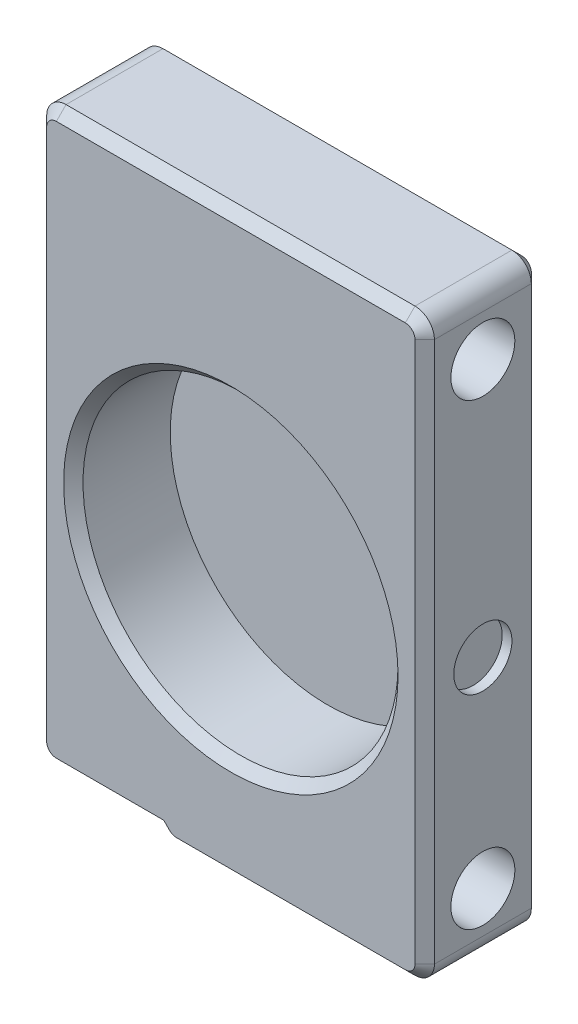
ISO-10303-21;
HEADER;
FILE_DESCRIPTION(('STEP AP214'),'2;1');
FILE_NAME('part.step','',(''),(''),'','','');
FILE_SCHEMA(('AUTOMOTIVE_DESIGN { 1 0 10303 214 1 1 1 1 }'));
ENDSEC;
DATA;
#1=APPLICATION_CONTEXT('core data for automotive mechanical design processes');
#2=APPLICATION_PROTOCOL_DEFINITION('international standard','automotive_design',2000,#1);
#3=PRODUCT_CONTEXT('',#1,'mechanical');
#4=PRODUCT('Part','Part','',(#3));
#5=PRODUCT_RELATED_PRODUCT_CATEGORY('part','',(#4));
#6=PRODUCT_DEFINITION_FORMATION('','',#4);
#7=PRODUCT_DEFINITION_CONTEXT('part definition',#1,'design');
#8=PRODUCT_DEFINITION('design','',#6,#7);
#9=PRODUCT_DEFINITION_SHAPE('','',#8);
#10=(LENGTH_UNIT() NAMED_UNIT(*) SI_UNIT(.MILLI.,.METRE.));
#11=(NAMED_UNIT(*) PLANE_ANGLE_UNIT() SI_UNIT($,.RADIAN.));
#12=(NAMED_UNIT(*) SI_UNIT($,.STERADIAN.) SOLID_ANGLE_UNIT());
#13=UNCERTAINTY_MEASURE_WITH_UNIT(LENGTH_MEASURE(1.E-05),#10,'distance_accuracy_value','');
#14=(GEOMETRIC_REPRESENTATION_CONTEXT(3) GLOBAL_UNCERTAINTY_ASSIGNED_CONTEXT((#13)) GLOBAL_UNIT_ASSIGNED_CONTEXT((#10,
#11,#12)) REPRESENTATION_CONTEXT('',''));
#15=CARTESIAN_POINT('',(0.,0.,0.));
#16=DIRECTION('',(0.,0.,1.));
#17=DIRECTION('',(1.,0.,0.));
#18=AXIS2_PLACEMENT_3D('',#15,#16,#17);
#19=CARTESIAN_POINT('',(-10.,-13.,6.));
#20=DIRECTION('',(1.,0.,0.));
#21=DIRECTION('',(0.,1.,0.));
#22=AXIS2_PLACEMENT_3D('',#19,#20,#21);
#23=PLANE('',#22);
#24=CARTESIAN_POINT('',(-10.,13.32,3.));
#25=DIRECTION('',(1.,0.,0.));
#26=DIRECTION('',(0.,0.,-1.));
#27=AXIS2_PLACEMENT_3D('',#24,#25,#26);
#28=CIRCLE('',#27,1.65);
#29=CARTESIAN_POINT('',(-10.,13.32,1.35));
#30=VERTEX_POINT('',#29);
#31=EDGE_CURVE('E984',#30,#30,#28,.T.);
#32=ORIENTED_EDGE('',*,*,#31,.T.);
#33=EDGE_LOOP('',(#32));
#34=FACE_BOUND('',#33,.T.);
#35=CARTESIAN_POINT('',(-10.,-10.3153910400944,3.));
#36=DIRECTION('',(1.,0.,0.));
#37=DIRECTION('',(0.,0.,1.));
#38=AXIS2_PLACEMENT_3D('',#35,#36,#37);
#39=CIRCLE('',#38,1.65);
#40=CARTESIAN_POINT('',(-10.,-10.3153910400944,4.65));
#41=VERTEX_POINT('',#40);
#42=EDGE_CURVE('E326',#41,#41,#39,.T.);
#43=ORIENTED_EDGE('',*,*,#42,.T.);
#44=EDGE_LOOP('',(#43));
#45=FACE_BOUND('',#44,.T.);
#46=DIRECTION('',(0.,0.,-1.));
#47=VECTOR('',#46,1.);
#48=CARTESIAN_POINT('',(-10.,15.45,6.));
#49=LINE('',#48,#47);
#50=CARTESIAN_POINT('',(-10.,15.45,5.5));
#51=VERTEX_POINT('',#50);
#52=CARTESIAN_POINT('',(-10.,15.45,0.499999999999997));
#53=VERTEX_POINT('',#52);
#54=EDGE_CURVE('E408',#51,#53,#49,.T.);
#55=ORIENTED_EDGE('',*,*,#54,.T.);
#56=DIRECTION('',(0.,-1.,0.));
#57=VECTOR('',#56,1.);
#58=CARTESIAN_POINT('',(-10.,-13.,0.499999999999997));
#59=LINE('',#58,#57);
#60=CARTESIAN_POINT('',(-10.,-12.,0.499999999999997));
#61=VERTEX_POINT('',#60);
#62=EDGE_CURVE('E252',#53,#61,#59,.T.);
#63=ORIENTED_EDGE('',*,*,#62,.T.);
#64=DIRECTION('',(0.,0.,-1.));
#65=VECTOR('',#64,1.);
#66=CARTESIAN_POINT('',(-10.,-12.,6.));
#67=LINE('',#66,#65);
#68=CARTESIAN_POINT('',(-10.,-12.,5.5));
#69=VERTEX_POINT('',#68);
#70=EDGE_CURVE('E404',#61,#69,#67,.F.);
#71=ORIENTED_EDGE('',*,*,#70,.T.);
#72=DIRECTION('',(0.,1.,0.));
#73=VECTOR('',#72,1.);
#74=CARTESIAN_POINT('',(-10.,15.45,5.5));
#75=LINE('',#74,#73);
#76=EDGE_CURVE('E250',#69,#51,#75,.T.);
#77=ORIENTED_EDGE('',*,*,#76,.T.);
#78=EDGE_LOOP('',(#55,#63,#71,#77));
#79=FACE_BOUND('',#78,.T.);
#80=ADVANCED_FACE('F45',(#34,#45,#79),#23,.F.);
#81=CARTESIAN_POINT('',(-10.,-13.,6.));
#82=DIRECTION('',(0.,1.,0.));
#83=DIRECTION('',(0.,0.,1.));
#84=AXIS2_PLACEMENT_3D('',#81,#82,#83);
#85=PLANE('',#84);
#86=DIRECTION('',(0.,0.,-1.));
#87=VECTOR('',#86,1.);
#88=CARTESIAN_POINT('',(-9.,-13.,6.));
#89=LINE('',#88,#87);
#90=CARTESIAN_POINT('',(-9.,-13.,5.5));
#91=VERTEX_POINT('',#90);
#92=CARTESIAN_POINT('',(-9.,-13.,0.499999999999997));
#93=VERTEX_POINT('',#92);
#94=EDGE_CURVE('E217',#91,#93,#89,.T.);
#95=ORIENTED_EDGE('',*,*,#94,.T.);
#96=DIRECTION('',(1.,0.,0.));
#97=VECTOR('',#96,1.);
#98=CARTESIAN_POINT('',(-10.,-13.,0.499999999999997));
#99=LINE('',#98,#97);
#100=CARTESIAN_POINT('',(-3.67004229435026,-13.,0.499999999999997));
#101=VERTEX_POINT('',#100);
#102=EDGE_CURVE('E262',#93,#101,#99,.T.);
#103=ORIENTED_EDGE('',*,*,#102,.T.);
#104=DIRECTION('',(0.,0.,-1.));
#105=VECTOR('',#104,1.);
#106=CARTESIAN_POINT('',(-3.67004229435026,-13.,6.));
#107=LINE('',#106,#105);
#108=CARTESIAN_POINT('',(-3.67004229435026,-13.,5.5));
#109=VERTEX_POINT('',#108);
#110=EDGE_CURVE('E488',#109,#101,#107,.T.);
#111=ORIENTED_EDGE('',*,*,#110,.F.);
#112=DIRECTION('',(-1.,0.,0.));
#113=VECTOR('',#112,1.);
#114=CARTESIAN_POINT('',(-9.,-13.,5.5));
#115=LINE('',#114,#113);
#116=EDGE_CURVE('E259',#109,#91,#115,.T.);
#117=ORIENTED_EDGE('',*,*,#116,.T.);
#118=EDGE_LOOP('',(#95,#103,#111,#117));
#119=FACE_BOUND('',#118,.T.);
#120=ADVANCED_FACE('F484',(#119),#85,.F.);
#121=CARTESIAN_POINT('',(-3.67004229435026,-13.,6.));
#122=DIRECTION('',(0.707106781186549,0.707106781186546,0.));
#123=DIRECTION('',(-0.707106781186546,0.707106781186549,0.));
#124=AXIS2_PLACEMENT_3D('',#121,#122,#123);
#125=PLANE('',#124);
#126=ORIENTED_EDGE('',*,*,#110,.T.);
#127=DIRECTION('',(0.707106781186546,-0.707106781186549,0.));
#128=VECTOR('',#127,1.);
#129=CARTESIAN_POINT('',(-3.67004229435026,-13.,0.499999999999997));
#130=LINE('',#129,#128);
#131=CARTESIAN_POINT('',(-3.51293551316371,-13.1571067811865,0.499999999999997));
#132=VERTEX_POINT('',#131);
#133=EDGE_CURVE('E266',#101,#132,#130,.T.);
#134=ORIENTED_EDGE('',*,*,#133,.T.);
#135=DIRECTION('',(0.,0.,1.));
#136=VECTOR('',#135,1.);
#137=CARTESIAN_POINT('',(-3.51293551316371,-13.1571067811865,6.));
#138=LINE('',#137,#136);
#139=CARTESIAN_POINT('',(-3.51293551316371,-13.1571067811865,5.5));
#140=VERTEX_POINT('',#139);
#141=EDGE_CURVE('E398',#132,#140,#138,.T.);
#142=ORIENTED_EDGE('',*,*,#141,.T.);
#143=DIRECTION('',(-0.707106781186546,0.707106781186549,0.));
#144=VECTOR('',#143,1.);
#145=CARTESIAN_POINT('',(-3.67004229435026,-13.,5.5));
#146=LINE('',#145,#144);
#147=EDGE_CURVE('E264',#140,#109,#146,.T.);
#148=ORIENTED_EDGE('',*,*,#147,.T.);
#149=EDGE_LOOP('',(#126,#134,#142,#148));
#150=FACE_BOUND('',#149,.T.);
#151=ADVANCED_FACE('F522',(#150),#125,.F.);
#152=CARTESIAN_POINT('',(10.,-13.5,6.));
#153=DIRECTION('',(-1.,0.,0.));
#154=DIRECTION('',(0.,0.,1.));
#155=AXIS2_PLACEMENT_3D('',#152,#153,#154);
#156=PLANE('',#155);
#157=CARTESIAN_POINT('',(10.,13.32,3.));
#158=DIRECTION('',(1.,0.,0.));
#159=DIRECTION('',(0.,0.,-1.));
#160=AXIS2_PLACEMENT_3D('',#157,#158,#159);
#161=CIRCLE('',#160,1.65);
#162=CARTESIAN_POINT('',(10.,13.32,1.35));
#163=VERTEX_POINT('',#162);
#164=EDGE_CURVE('E993',#163,#163,#161,.T.);
#165=ORIENTED_EDGE('',*,*,#164,.F.);
#166=EDGE_LOOP('',(#165));
#167=FACE_BOUND('',#166,.T.);
#168=CARTESIAN_POINT('',(10.,-10.3153910400944,3.));
#169=DIRECTION('',(1.,0.,0.));
#170=DIRECTION('',(0.,0.,1.));
#171=AXIS2_PLACEMENT_3D('',#168,#169,#170);
#172=CIRCLE('',#171,1.65);
#173=CARTESIAN_POINT('',(10.,-10.3153910400944,4.65));
#174=VERTEX_POINT('',#173);
#175=EDGE_CURVE('E989',#174,#174,#172,.T.);
#176=ORIENTED_EDGE('',*,*,#175,.F.);
#177=EDGE_LOOP('',(#176));
#178=FACE_BOUND('',#177,.T.);
#179=CARTESIAN_POINT('',(10.,0.,3.));
#180=DIRECTION('',(1.,0.,0.));
#181=DIRECTION('',(0.,0.,-1.));
#182=AXIS2_PLACEMENT_3D('',#179,#180,#181);
#183=CIRCLE('',#182,1.5);
#184=CARTESIAN_POINT('',(10.,0.,1.5));
#185=VERTEX_POINT('',#184);
#186=EDGE_CURVE('E975',#185,#185,#183,.T.);
#187=ORIENTED_EDGE('',*,*,#186,.F.);
#188=EDGE_LOOP('',(#187));
#189=FACE_BOUND('',#188,.T.);
#190=DIRECTION('',(0.,0.,-1.));
#191=VECTOR('',#190,1.);
#192=CARTESIAN_POINT('',(10.,-12.45,6.));
#193=LINE('',#192,#191);
#194=CARTESIAN_POINT('',(10.,-12.45,5.5));
#195=VERTEX_POINT('',#194);
#196=CARTESIAN_POINT('',(10.,-12.45,0.499999999999997));
#197=VERTEX_POINT('',#196);
#198=EDGE_CURVE('E396',#195,#197,#193,.T.);
#199=ORIENTED_EDGE('',*,*,#198,.T.);
#200=DIRECTION('',(0.,1.,0.));
#201=VECTOR('',#200,1.);
#202=CARTESIAN_POINT('',(10.,-13.5,0.499999999999997));
#203=LINE('',#202,#201);
#204=CARTESIAN_POINT('',(10.,15.45,0.499999999999997));
#205=VERTEX_POINT('',#204);
#206=EDGE_CURVE('E235',#197,#205,#203,.T.);
#207=ORIENTED_EDGE('',*,*,#206,.T.);
#208=DIRECTION('',(0.,0.,-1.));
#209=VECTOR('',#208,1.);
#210=CARTESIAN_POINT('',(10.,15.45,6.));
#211=LINE('',#210,#209);
#212=CARTESIAN_POINT('',(10.,15.45,5.5));
#213=VERTEX_POINT('',#212);
#214=EDGE_CURVE('E393',#205,#213,#211,.F.);
#215=ORIENTED_EDGE('',*,*,#214,.T.);
#216=DIRECTION('',(0.,-1.,0.));
#217=VECTOR('',#216,1.);
#218=CARTESIAN_POINT('',(10.,-12.45,5.5));
#219=LINE('',#218,#217);
#220=EDGE_CURVE('E232',#213,#195,#219,.T.);
#221=ORIENTED_EDGE('',*,*,#220,.T.);
#222=EDGE_LOOP('',(#199,#207,#215,#221));
#223=FACE_BOUND('',#222,.T.);
#224=ADVANCED_FACE('F446',(#167,#178,#189,#223),#156,.F.);
#225=CARTESIAN_POINT('',(0.,0.,6.));
#226=DIRECTION('',(0.,0.,1.));
#227=DIRECTION('',(1.,0.,0.));
#228=AXIS2_PLACEMENT_3D('',#225,#226,#227);
#229=PLANE('',#228);
#230=CARTESIAN_POINT('',(0.,0.,6.));
#231=DIRECTION('',(0.,0.,1.));
#232=DIRECTION('',(1.,0.,0.));
#233=AXIS2_PLACEMENT_3D('',#230,#231,#232);
#234=CIRCLE('',#233,8.62500000000002);
#235=CARTESIAN_POINT('',(8.62500000000002,0.,6.));
#236=VERTEX_POINT('',#235);
#237=EDGE_CURVE('E11',#236,#236,#234,.F.);
#238=ORIENTED_EDGE('',*,*,#237,.T.);
#239=EDGE_LOOP('',(#238));
#240=FACE_BOUND('',#239,.T.);
#241=CARTESIAN_POINT('',(-9.,-12.,6.));
#242=DIRECTION('',(0.,0.,1.));
#243=DIRECTION('',(1.,0.,0.));
#244=AXIS2_PLACEMENT_3D('',#241,#242,#243);
#245=CIRCLE('',#244,0.500000000000002);
#246=CARTESIAN_POINT('',(-9.5,-12.,6.));
#247=VERTEX_POINT('',#246);
#248=CARTESIAN_POINT('',(-9.,-12.5,6.));
#249=VERTEX_POINT('',#248);
#250=EDGE_CURVE('E63',#247,#249,#245,.T.);
#251=ORIENTED_EDGE('',*,*,#250,.T.);
#252=DIRECTION('',(1.,0.,0.));
#253=VECTOR('',#252,1.);
#254=CARTESIAN_POINT('',(-3.67004229435026,-12.5,6.));
#255=LINE('',#254,#253);
#256=CARTESIAN_POINT('',(-3.46293551316371,-12.5,6.));
#257=VERTEX_POINT('',#256);
#258=EDGE_CURVE('E55',#249,#257,#255,.T.);
#259=ORIENTED_EDGE('',*,*,#258,.T.);
#260=DIRECTION('',(0.707106781186546,-0.707106781186549,0.));
#261=VECTOR('',#260,1.);
#262=CARTESIAN_POINT('',(-3.15938212257044,-12.8035533905933,6.));
#263=LINE('',#262,#261);
#264=CARTESIAN_POINT('',(-3.15938212257044,-12.8035533905933,6.));
#265=VERTEX_POINT('',#264);
#266=EDGE_CURVE('E280',#257,#265,#263,.T.);
#267=ORIENTED_EDGE('',*,*,#266,.T.);
#268=CARTESIAN_POINT('',(-2.80582873197717,-12.45,6.));
#269=DIRECTION('',(0.,0.,1.));
#270=DIRECTION('',(1.,0.,0.));
#271=AXIS2_PLACEMENT_3D('',#268,#269,#270);
#272=CIRCLE('',#271,0.5);
#273=CARTESIAN_POINT('',(-2.80582873197716,-12.95,6.));
#274=VERTEX_POINT('',#273);
#275=EDGE_CURVE('E282',#265,#274,#272,.T.);
#276=ORIENTED_EDGE('',*,*,#275,.T.);
#277=DIRECTION('',(1.,0.,0.));
#278=VECTOR('',#277,1.);
#279=CARTESIAN_POINT('',(9.,-12.95,6.));
#280=LINE('',#279,#278);
#281=CARTESIAN_POINT('',(9.,-12.95,6.));
#282=VERTEX_POINT('',#281);
#283=EDGE_CURVE('E284',#274,#282,#280,.T.);
#284=ORIENTED_EDGE('',*,*,#283,.T.);
#285=CARTESIAN_POINT('',(9.,-12.45,6.));
#286=DIRECTION('',(0.,0.,1.));
#287=DIRECTION('',(1.,0.,0.));
#288=AXIS2_PLACEMENT_3D('',#285,#286,#287);
#289=CIRCLE('',#288,0.500000000000002);
#290=CARTESIAN_POINT('',(9.5,-12.45,6.));
#291=VERTEX_POINT('',#290);
#292=EDGE_CURVE('E286',#282,#291,#289,.T.);
#293=ORIENTED_EDGE('',*,*,#292,.T.);
#294=DIRECTION('',(0.,1.,0.));
#295=VECTOR('',#294,1.);
#296=CARTESIAN_POINT('',(9.5,15.45,6.));
#297=LINE('',#296,#295);
#298=CARTESIAN_POINT('',(9.5,15.45,6.));
#299=VERTEX_POINT('',#298);
#300=EDGE_CURVE('E288',#291,#299,#297,.T.);
#301=ORIENTED_EDGE('',*,*,#300,.T.);
#302=CARTESIAN_POINT('',(9.,15.45,6.));
#303=DIRECTION('',(0.,0.,1.));
#304=DIRECTION('',(1.,0.,0.));
#305=AXIS2_PLACEMENT_3D('',#302,#303,#304);
#306=CIRCLE('',#305,0.500000000000004);
#307=CARTESIAN_POINT('',(9.,15.95,6.));
#308=VERTEX_POINT('',#307);
#309=EDGE_CURVE('E290',#299,#308,#306,.T.);
#310=ORIENTED_EDGE('',*,*,#309,.T.);
#311=DIRECTION('',(-1.,0.,0.));
#312=VECTOR('',#311,1.);
#313=CARTESIAN_POINT('',(-9.00000000000001,15.95,6.));
#314=LINE('',#313,#312);
#315=CARTESIAN_POINT('',(-9.00000000000001,15.95,6.));
#316=VERTEX_POINT('',#315);
#317=EDGE_CURVE('E292',#308,#316,#314,.T.);
#318=ORIENTED_EDGE('',*,*,#317,.T.);
#319=CARTESIAN_POINT('',(-9.,15.45,6.));
#320=DIRECTION('',(0.,0.,1.));
#321=DIRECTION('',(1.,0.,0.));
#322=AXIS2_PLACEMENT_3D('',#319,#320,#321);
#323=CIRCLE('',#322,0.500000000000002);
#324=CARTESIAN_POINT('',(-9.50000000000001,15.45,6.));
#325=VERTEX_POINT('',#324);
#326=EDGE_CURVE('E294',#316,#325,#323,.T.);
#327=ORIENTED_EDGE('',*,*,#326,.T.);
#328=DIRECTION('',(0.,-1.,0.));
#329=VECTOR('',#328,1.);
#330=CARTESIAN_POINT('',(-9.5,-12.,6.));
#331=LINE('',#330,#329);
#332=EDGE_CURVE('E68',#325,#247,#331,.T.);
#333=ORIENTED_EDGE('',*,*,#332,.T.);
#334=EDGE_LOOP('',(#251,#259,#267,#276,#284,#293,#301,#310,#318,#327,#333));
#335=FACE_BOUND('',#334,.T.);
#336=ADVANCED_FACE('F367',(#240,#335),#229,.T.);
#337=CARTESIAN_POINT('',(0.,0.,0.));
#338=DIRECTION('',(0.,0.,1.));
#339=DIRECTION('',(1.,0.,0.));
#340=AXIS2_PLACEMENT_3D('',#337,#338,#339);
#341=PLANE('',#340);
#342=DIRECTION('',(0.,-1.,0.));
#343=VECTOR('',#342,1.);
#344=CARTESIAN_POINT('',(9.5,0.,0.));
#345=LINE('',#344,#343);
#346=CARTESIAN_POINT('',(9.5,15.45,0.));
#347=VERTEX_POINT('',#346);
#348=CARTESIAN_POINT('',(9.5,-12.45,0.));
#349=VERTEX_POINT('',#348);
#350=EDGE_CURVE('E221',#347,#349,#345,.T.);
#351=ORIENTED_EDGE('',*,*,#350,.T.);
#352=CARTESIAN_POINT('',(9.,-12.45,0.));
#353=DIRECTION('',(0.,0.,1.));
#354=DIRECTION('',(1.,0.,0.));
#355=AXIS2_PLACEMENT_3D('',#352,#353,#354);
#356=CIRCLE('',#355,0.500000000000004);
#357=CARTESIAN_POINT('',(9.,-12.95,0.));
#358=VERTEX_POINT('',#357);
#359=EDGE_CURVE('E202',#349,#358,#356,.F.);
#360=ORIENTED_EDGE('',*,*,#359,.T.);
#361=DIRECTION('',(-1.,0.,0.));
#362=VECTOR('',#361,1.);
#363=CARTESIAN_POINT('',(0.,-12.95,0.));
#364=LINE('',#363,#362);
#365=CARTESIAN_POINT('',(-2.80582873197716,-12.95,0.));
#366=VERTEX_POINT('',#365);
#367=EDGE_CURVE('E210',#358,#366,#364,.T.);
#368=ORIENTED_EDGE('',*,*,#367,.T.);
#369=CARTESIAN_POINT('',(-2.80582873197717,-12.45,0.));
#370=DIRECTION('',(0.,0.,1.));
#371=DIRECTION('',(1.,0.,0.));
#372=AXIS2_PLACEMENT_3D('',#369,#370,#371);
#373=CIRCLE('',#372,0.500000000000003);
#374=CARTESIAN_POINT('',(-3.15938212257044,-12.8035533905933,0.));
#375=VERTEX_POINT('',#374);
#376=EDGE_CURVE('E216',#366,#375,#373,.F.);
#377=ORIENTED_EDGE('',*,*,#376,.T.);
#378=DIRECTION('',(-0.707106781186546,0.707106781186549,0.));
#379=VECTOR('',#378,1.);
#380=CARTESIAN_POINT('',(-7.98146775658186,-7.98146775658184,0.));
#381=LINE('',#380,#379);
#382=CARTESIAN_POINT('',(-3.46293551316371,-12.5,0.));
#383=VERTEX_POINT('',#382);
#384=EDGE_CURVE('E420',#375,#383,#381,.T.);
#385=ORIENTED_EDGE('',*,*,#384,.T.);
#386=DIRECTION('',(-1.,0.,0.));
#387=VECTOR('',#386,1.);
#388=CARTESIAN_POINT('',(0.,-12.5,0.));
#389=LINE('',#388,#387);
#390=CARTESIAN_POINT('',(-9.,-12.5,0.));
#391=VERTEX_POINT('',#390);
#392=EDGE_CURVE('E422',#383,#391,#389,.T.);
#393=ORIENTED_EDGE('',*,*,#392,.T.);
#394=CARTESIAN_POINT('',(-9.,-12.,0.));
#395=DIRECTION('',(0.,0.,1.));
#396=DIRECTION('',(1.,0.,0.));
#397=AXIS2_PLACEMENT_3D('',#394,#395,#396);
#398=CIRCLE('',#397,0.500000000000002);
#399=CARTESIAN_POINT('',(-9.5,-12.,0.));
#400=VERTEX_POINT('',#399);
#401=EDGE_CURVE('E424',#391,#400,#398,.F.);
#402=ORIENTED_EDGE('',*,*,#401,.T.);
#403=DIRECTION('',(0.,1.,0.));
#404=VECTOR('',#403,1.);
#405=CARTESIAN_POINT('',(-9.5,0.,0.));
#406=LINE('',#405,#404);
#407=CARTESIAN_POINT('',(-9.50000000000001,15.45,0.));
#408=VERTEX_POINT('',#407);
#409=EDGE_CURVE('E426',#400,#408,#406,.T.);
#410=ORIENTED_EDGE('',*,*,#409,.T.);
#411=CARTESIAN_POINT('',(-9.,15.45,0.));
#412=DIRECTION('',(0.,0.,1.));
#413=DIRECTION('',(1.,0.,0.));
#414=AXIS2_PLACEMENT_3D('',#411,#412,#413);
#415=CIRCLE('',#414,0.500000000000002);
#416=CARTESIAN_POINT('',(-9.00000000000001,15.95,0.));
#417=VERTEX_POINT('',#416);
#418=EDGE_CURVE('E428',#408,#417,#415,.F.);
#419=ORIENTED_EDGE('',*,*,#418,.T.);
#420=DIRECTION('',(1.,0.,0.));
#421=VECTOR('',#420,1.);
#422=CARTESIAN_POINT('',(0.,15.95,0.));
#423=LINE('',#422,#421);
#424=CARTESIAN_POINT('',(9.,15.95,0.));
#425=VERTEX_POINT('',#424);
#426=EDGE_CURVE('E430',#417,#425,#423,.T.);
#427=ORIENTED_EDGE('',*,*,#426,.T.);
#428=CARTESIAN_POINT('',(9.,15.45,0.));
#429=DIRECTION('',(0.,0.,1.));
#430=DIRECTION('',(1.,0.,0.));
#431=AXIS2_PLACEMENT_3D('',#428,#429,#430);
#432=CIRCLE('',#431,0.500000000000004);
#433=EDGE_CURVE('E227',#425,#347,#432,.F.);
#434=ORIENTED_EDGE('',*,*,#433,.T.);
#435=EDGE_LOOP('',(#351,#360,#368,#377,#385,#393,#402,#410,#419,#427,#434));
#436=FACE_BOUND('',#435,.T.);
#437=ADVANCED_FACE('F219',(#436),#341,.F.);
#438=CARTESIAN_POINT('',(0.,0.,1.));
#439=DIRECTION('',(0.,0.,1.));
#440=DIRECTION('',(1.,0.,0.));
#441=AXIS2_PLACEMENT_3D('',#438,#439,#440);
#442=CYLINDRICAL_SURFACE('',#441,8.125);
#443=CARTESIAN_POINT('',(0.,0.,5.49999999999999));
#444=DIRECTION('',(0.,0.,1.));
#445=DIRECTION('',(1.,0.,0.));
#446=AXIS2_PLACEMENT_3D('',#443,#444,#445);
#447=CIRCLE('',#446,8.125);
#448=CARTESIAN_POINT('',(8.125,0.,5.49999999999999));
#449=VERTEX_POINT('',#448);
#450=EDGE_CURVE('E276',#449,#449,#447,.T.);
#451=ORIENTED_EDGE('',*,*,#450,.T.);
#452=EDGE_LOOP('',(#451));
#453=FACE_BOUND('',#452,.T.);
#454=CARTESIAN_POINT('',(0.,0.,1.));
#455=DIRECTION('',(0.,0.,1.));
#456=DIRECTION('',(1.,0.,0.));
#457=AXIS2_PLACEMENT_3D('',#454,#455,#456);
#458=CIRCLE('',#457,8.125);
#459=CARTESIAN_POINT('',(8.125,0.,1.));
#460=VERTEX_POINT('',#459);
#461=EDGE_CURVE('E967',#460,#460,#458,.T.);
#462=ORIENTED_EDGE('',*,*,#461,.F.);
#463=EDGE_LOOP('',(#462));
#464=FACE_BOUND('',#463,.T.);
#465=ADVANCED_FACE('F758',(#453,#464),#442,.F.);
#466=CARTESIAN_POINT('',(0.,0.,1.));
#467=DIRECTION('',(0.,0.,1.));
#468=DIRECTION('',(1.,0.,0.));
#469=AXIS2_PLACEMENT_3D('',#466,#467,#468);
#470=PLANE('',#469);
#471=ORIENTED_EDGE('',*,*,#461,.T.);
#472=EDGE_LOOP('',(#471));
#473=FACE_BOUND('',#472,.T.);
#474=ADVANCED_FACE('F763',(#473),#470,.T.);
#475=CARTESIAN_POINT('',(9.5,0.,3.));
#476=DIRECTION('',(1.,0.,0.));
#477=DIRECTION('',(0.,0.,-1.));
#478=AXIS2_PLACEMENT_3D('',#475,#476,#477);
#479=CYLINDRICAL_SURFACE('',#478,1.5);
#480=CARTESIAN_POINT('',(9.5,0.,3.));
#481=DIRECTION('',(1.,0.,0.));
#482=DIRECTION('',(0.,0.,-1.));
#483=AXIS2_PLACEMENT_3D('',#480,#481,#482);
#484=CIRCLE('',#483,1.5);
#485=CARTESIAN_POINT('',(9.5,0.,1.5));
#486=VERTEX_POINT('',#485);
#487=EDGE_CURVE('E970',#486,#486,#484,.T.);
#488=ORIENTED_EDGE('',*,*,#487,.F.);
#489=EDGE_LOOP('',(#488));
#490=FACE_BOUND('',#489,.T.);
#491=ORIENTED_EDGE('',*,*,#186,.T.);
#492=EDGE_LOOP('',(#491));
#493=FACE_BOUND('',#492,.T.);
#494=ADVANCED_FACE('F843',(#490,#493),#479,.F.);
#495=CARTESIAN_POINT('',(9.5,0.,3.));
#496=DIRECTION('',(1.,0.,0.));
#497=DIRECTION('',(0.,0.,-1.));
#498=AXIS2_PLACEMENT_3D('',#495,#496,#497);
#499=PLANE('',#498);
#500=ORIENTED_EDGE('',*,*,#487,.T.);
#501=EDGE_LOOP('',(#500));
#502=FACE_BOUND('',#501,.T.);
#503=ADVANCED_FACE('F833',(#502),#499,.T.);
#504=CARTESIAN_POINT('',(-10.,-10.3153910400944,3.));
#505=DIRECTION('',(1.,0.,0.));
#506=DIRECTION('',(0.,0.,-1.));
#507=AXIS2_PLACEMENT_3D('',#504,#505,#506);
#508=CYLINDRICAL_SURFACE('',#507,1.65);
#509=ORIENTED_EDGE('',*,*,#42,.F.);
#510=EDGE_LOOP('',(#509));
#511=FACE_BOUND('',#510,.T.);
#512=ORIENTED_EDGE('',*,*,#175,.T.);
#513=EDGE_LOOP('',(#512));
#514=FACE_BOUND('',#513,.T.);
#515=ADVANCED_FACE('F822',(#511,#514),#508,.F.);
#516=CARTESIAN_POINT('',(-10.,13.32,3.));
#517=DIRECTION('',(1.,0.,0.));
#518=DIRECTION('',(0.,0.,-1.));
#519=AXIS2_PLACEMENT_3D('',#516,#517,#518);
#520=CYLINDRICAL_SURFACE('',#519,1.65);
#521=ORIENTED_EDGE('',*,*,#31,.F.);
#522=EDGE_LOOP('',(#521));
#523=FACE_BOUND('',#522,.T.);
#524=ORIENTED_EDGE('',*,*,#164,.T.);
#525=EDGE_LOOP('',(#524));
#526=FACE_BOUND('',#525,.T.);
#527=ADVANCED_FACE('F752',(#523,#526),#520,.F.);
#528=CARTESIAN_POINT('',(10.,-13.45,6.));
#529=DIRECTION('',(0.,1.,0.));
#530=DIRECTION('',(0.,0.,1.));
#531=AXIS2_PLACEMENT_3D('',#528,#529,#530);
#532=PLANE('',#531);
#533=DIRECTION('',(0.,0.,1.));
#534=VECTOR('',#533,1.);
#535=CARTESIAN_POINT('',(-2.80582873197716,-13.45,6.));
#536=LINE('',#535,#534);
#537=CARTESIAN_POINT('',(-2.80582873197716,-13.45,5.5));
#538=VERTEX_POINT('',#537);
#539=CARTESIAN_POINT('',(-2.80582873197716,-13.45,0.499999999999997));
#540=VERTEX_POINT('',#539);
#541=EDGE_CURVE('E385',#538,#540,#536,.F.);
#542=ORIENTED_EDGE('',*,*,#541,.T.);
#543=DIRECTION('',(1.,0.,0.));
#544=VECTOR('',#543,1.);
#545=CARTESIAN_POINT('',(10.,-13.45,0.499999999999997));
#546=LINE('',#545,#544);
#547=CARTESIAN_POINT('',(9.,-13.45,0.499999999999997));
#548=VERTEX_POINT('',#547);
#549=EDGE_CURVE('E274',#540,#548,#546,.T.);
#550=ORIENTED_EDGE('',*,*,#549,.T.);
#551=DIRECTION('',(0.,0.,-1.));
#552=VECTOR('',#551,1.);
#553=CARTESIAN_POINT('',(9.,-13.45,6.));
#554=LINE('',#553,#552);
#555=CARTESIAN_POINT('',(9.,-13.45,5.5));
#556=VERTEX_POINT('',#555);
#557=EDGE_CURVE('E387',#548,#556,#554,.F.);
#558=ORIENTED_EDGE('',*,*,#557,.T.);
#559=DIRECTION('',(-1.,0.,0.));
#560=VECTOR('',#559,1.);
#561=CARTESIAN_POINT('',(-2.80582873197716,-13.45,5.5));
#562=LINE('',#561,#560);
#563=EDGE_CURVE('E272',#556,#538,#562,.T.);
#564=ORIENTED_EDGE('',*,*,#563,.T.);
#565=EDGE_LOOP('',(#542,#550,#558,#564));
#566=FACE_BOUND('',#565,.T.);
#567=ADVANCED_FACE('F384',(#566),#532,.F.);
#568=CARTESIAN_POINT('',(10.,16.45,6.));
#569=DIRECTION('',(0.,-1.,0.));
#570=DIRECTION('',(0.,0.,-1.));
#571=AXIS2_PLACEMENT_3D('',#568,#569,#570);
#572=PLANE('',#571);
#573=DIRECTION('',(0.,0.,-1.));
#574=VECTOR('',#573,1.);
#575=CARTESIAN_POINT('',(9.,16.45,6.));
#576=LINE('',#575,#574);
#577=CARTESIAN_POINT('',(9.,16.45,5.5));
#578=VERTEX_POINT('',#577);
#579=CARTESIAN_POINT('',(9.,16.45,0.499999999999997));
#580=VERTEX_POINT('',#579);
#581=EDGE_CURVE('E411',#578,#580,#576,.T.);
#582=ORIENTED_EDGE('',*,*,#581,.T.);
#583=DIRECTION('',(-1.,0.,0.));
#584=VECTOR('',#583,1.);
#585=CARTESIAN_POINT('',(10.,16.45,0.499999999999997));
#586=LINE('',#585,#584);
#587=CARTESIAN_POINT('',(-9.00000000000001,16.45,0.499999999999997));
#588=VERTEX_POINT('',#587);
#589=EDGE_CURVE('E244',#580,#588,#586,.T.);
#590=ORIENTED_EDGE('',*,*,#589,.T.);
#591=DIRECTION('',(0.,0.,-1.));
#592=VECTOR('',#591,1.);
#593=CARTESIAN_POINT('',(-9.00000000000001,16.45,6.));
#594=LINE('',#593,#592);
#595=CARTESIAN_POINT('',(-9.00000000000001,16.45,5.5));
#596=VERTEX_POINT('',#595);
#597=EDGE_CURVE('E414',#588,#596,#594,.F.);
#598=ORIENTED_EDGE('',*,*,#597,.T.);
#599=DIRECTION('',(1.,0.,0.));
#600=VECTOR('',#599,1.);
#601=CARTESIAN_POINT('',(9.,16.45,5.5));
#602=LINE('',#601,#600);
#603=EDGE_CURVE('E242',#596,#578,#602,.T.);
#604=ORIENTED_EDGE('',*,*,#603,.T.);
#605=EDGE_LOOP('',(#582,#590,#598,#604));
#606=FACE_BOUND('',#605,.T.);
#607=ADVANCED_FACE('F452',(#606),#572,.F.);
#608=CARTESIAN_POINT('',(-2.80582873197717,-12.45,6.));
#609=DIRECTION('',(0.,0.,1.));
#610=DIRECTION('',(1.,0.,0.));
#611=AXIS2_PLACEMENT_3D('',#608,#609,#610);
#612=CYLINDRICAL_SURFACE('',#611,1.);
#613=ORIENTED_EDGE('',*,*,#141,.F.);
#614=CARTESIAN_POINT('',(-2.80582873197717,-12.45,0.499999999999997));
#615=DIRECTION('',(0.,0.,1.));
#616=DIRECTION('',(1.,0.,0.));
#617=AXIS2_PLACEMENT_3D('',#614,#615,#616);
#618=CIRCLE('',#617,1.);
#619=EDGE_CURVE('E270',#132,#540,#618,.T.);
#620=ORIENTED_EDGE('',*,*,#619,.T.);
#621=ORIENTED_EDGE('',*,*,#541,.F.);
#622=CARTESIAN_POINT('',(-2.80582873197717,-12.45,5.5));
#623=DIRECTION('',(0.,0.,1.));
#624=DIRECTION('',(1.,0.,0.));
#625=AXIS2_PLACEMENT_3D('',#622,#623,#624);
#626=CIRCLE('',#625,1.);
#627=EDGE_CURVE('E268',#538,#140,#626,.F.);
#628=ORIENTED_EDGE('',*,*,#627,.T.);
#629=EDGE_LOOP('',(#613,#620,#621,#628));
#630=FACE_BOUND('',#629,.T.);
#631=ADVANCED_FACE('F390',(#630),#612,.T.);
#632=CARTESIAN_POINT('',(9.,-12.45,6.));
#633=DIRECTION('',(0.,0.,-1.));
#634=DIRECTION('',(-1.,0.,0.));
#635=AXIS2_PLACEMENT_3D('',#632,#633,#634);
#636=CYLINDRICAL_SURFACE('',#635,1.);
#637=ORIENTED_EDGE('',*,*,#557,.F.);
#638=CARTESIAN_POINT('',(9.,-12.45,0.499999999999997));
#639=DIRECTION('',(0.,0.,1.));
#640=DIRECTION('',(1.,0.,0.));
#641=AXIS2_PLACEMENT_3D('',#638,#639,#640);
#642=CIRCLE('',#641,1.);
#643=EDGE_CURVE('E204',#548,#197,#642,.T.);
#644=ORIENTED_EDGE('',*,*,#643,.T.);
#645=ORIENTED_EDGE('',*,*,#198,.F.);
#646=CARTESIAN_POINT('',(9.,-12.45,5.5));
#647=DIRECTION('',(0.,0.,1.));
#648=DIRECTION('',(1.,0.,0.));
#649=AXIS2_PLACEMENT_3D('',#646,#647,#648);
#650=CIRCLE('',#649,1.);
#651=EDGE_CURVE('E223',#195,#556,#650,.F.);
#652=ORIENTED_EDGE('',*,*,#651,.T.);
#653=EDGE_LOOP('',(#637,#644,#645,#652));
#654=FACE_BOUND('',#653,.T.);
#655=ADVANCED_FACE('F445',(#654),#636,.T.);
#656=CARTESIAN_POINT('',(-9.,15.45,6.));
#657=DIRECTION('',(0.,0.,-1.));
#658=DIRECTION('',(-1.,0.,0.));
#659=AXIS2_PLACEMENT_3D('',#656,#657,#658);
#660=CYLINDRICAL_SURFACE('',#659,1.);
#661=ORIENTED_EDGE('',*,*,#597,.F.);
#662=CARTESIAN_POINT('',(-9.,15.45,0.499999999999997));
#663=DIRECTION('',(0.,0.,1.));
#664=DIRECTION('',(1.,0.,0.));
#665=AXIS2_PLACEMENT_3D('',#662,#663,#664);
#666=CIRCLE('',#665,1.);
#667=EDGE_CURVE('E248',#588,#53,#666,.T.);
#668=ORIENTED_EDGE('',*,*,#667,.T.);
#669=ORIENTED_EDGE('',*,*,#54,.F.);
#670=CARTESIAN_POINT('',(-9.,15.45,5.5));
#671=DIRECTION('',(0.,0.,1.));
#672=DIRECTION('',(1.,0.,0.));
#673=AXIS2_PLACEMENT_3D('',#670,#671,#672);
#674=CIRCLE('',#673,1.);
#675=EDGE_CURVE('E246',#51,#596,#674,.F.);
#676=ORIENTED_EDGE('',*,*,#675,.T.);
#677=EDGE_LOOP('',(#661,#668,#669,#676));
#678=FACE_BOUND('',#677,.T.);
#679=ADVANCED_FACE('F464',(#678),#660,.T.);
#680=CARTESIAN_POINT('',(9.,15.45,6.));
#681=DIRECTION('',(0.,0.,-1.));
#682=DIRECTION('',(-1.,0.,0.));
#683=AXIS2_PLACEMENT_3D('',#680,#681,#682);
#684=CYLINDRICAL_SURFACE('',#683,1.);
#685=ORIENTED_EDGE('',*,*,#214,.F.);
#686=CARTESIAN_POINT('',(9.,15.45,0.499999999999997));
#687=DIRECTION('',(0.,0.,1.));
#688=DIRECTION('',(1.,0.,0.));
#689=AXIS2_PLACEMENT_3D('',#686,#687,#688);
#690=CIRCLE('',#689,1.);
#691=EDGE_CURVE('E240',#205,#580,#690,.T.);
#692=ORIENTED_EDGE('',*,*,#691,.T.);
#693=ORIENTED_EDGE('',*,*,#581,.F.);
#694=CARTESIAN_POINT('',(9.,15.45,5.5));
#695=DIRECTION('',(0.,0.,1.));
#696=DIRECTION('',(1.,0.,0.));
#697=AXIS2_PLACEMENT_3D('',#694,#695,#696);
#698=CIRCLE('',#697,1.);
#699=EDGE_CURVE('E238',#578,#213,#698,.F.);
#700=ORIENTED_EDGE('',*,*,#699,.T.);
#701=EDGE_LOOP('',(#685,#692,#693,#700));
#702=FACE_BOUND('',#701,.T.);
#703=ADVANCED_FACE('F448',(#702),#684,.T.);
#704=CARTESIAN_POINT('',(-9.,-12.,6.));
#705=DIRECTION('',(0.,0.,-1.));
#706=DIRECTION('',(-1.,0.,0.));
#707=AXIS2_PLACEMENT_3D('',#704,#705,#706);
#708=CYLINDRICAL_SURFACE('',#707,1.);
#709=ORIENTED_EDGE('',*,*,#70,.F.);
#710=CARTESIAN_POINT('',(-9.,-12.,0.499999999999997));
#711=DIRECTION('',(0.,0.,1.));
#712=DIRECTION('',(1.,0.,0.));
#713=AXIS2_PLACEMENT_3D('',#710,#711,#712);
#714=CIRCLE('',#713,1.);
#715=EDGE_CURVE('E257',#61,#93,#714,.T.);
#716=ORIENTED_EDGE('',*,*,#715,.T.);
#717=ORIENTED_EDGE('',*,*,#94,.F.);
#718=CARTESIAN_POINT('',(-9.,-12.,5.5));
#719=DIRECTION('',(0.,0.,1.));
#720=DIRECTION('',(1.,0.,0.));
#721=AXIS2_PLACEMENT_3D('',#718,#719,#720);
#722=CIRCLE('',#721,1.);
#723=EDGE_CURVE('E255',#91,#69,#722,.F.);
#724=ORIENTED_EDGE('',*,*,#723,.T.);
#725=EDGE_LOOP('',(#709,#716,#717,#724));
#726=FACE_BOUND('',#725,.T.);
#727=ADVANCED_FACE('F482',(#726),#708,.T.);
#728=CARTESIAN_POINT('',(-10.,-13.,0.499999999999997));
#729=DIRECTION('',(0.707106781186547,0.,0.707106781186548));
#730=DIRECTION('',(0.,-1.,0.));
#731=AXIS2_PLACEMENT_3D('',#728,#729,#730);
#732=PLANE('',#731);
#733=DIRECTION('',(-0.707106781186547,0.,0.707106781186547));
#734=VECTOR('',#733,1.);
#735=CARTESIAN_POINT('',(-9.50000000000001,15.45,0.));
#736=LINE('',#735,#734);
#737=EDGE_CURVE('E320',#408,#53,#736,.T.);
#738=ORIENTED_EDGE('',*,*,#737,.F.);
#739=ORIENTED_EDGE('',*,*,#409,.F.);
#740=DIRECTION('',(0.707106781186547,0.,-0.707106781186547));
#741=VECTOR('',#740,1.);
#742=CARTESIAN_POINT('',(-10.,-12.,0.499999999999997));
#743=LINE('',#742,#741);
#744=EDGE_CURVE('E323',#61,#400,#743,.T.);
#745=ORIENTED_EDGE('',*,*,#744,.F.);
#746=ORIENTED_EDGE('',*,*,#62,.F.);
#747=EDGE_LOOP('',(#738,#739,#745,#746));
#748=FACE_BOUND('',#747,.T.);
#749=ADVANCED_FACE('F472',(#748),#732,.F.);
#750=CARTESIAN_POINT('',(-9.,-12.,0.));
#751=DIRECTION('',(0.,0.,1.));
#752=DIRECTION('',(1.,0.,0.));
#753=AXIS2_PLACEMENT_3D('',#750,#751,#752);
#754=CONICAL_SURFACE('',#753,0.500000000000002,0.785398163397449);
#755=ORIENTED_EDGE('',*,*,#744,.T.);
#756=ORIENTED_EDGE('',*,*,#401,.F.);
#757=DIRECTION('',(0.,0.707106781186549,-0.707106781186546));
#758=VECTOR('',#757,1.);
#759=CARTESIAN_POINT('',(-9.,-13.,0.499999999999997));
#760=LINE('',#759,#758);
#761=EDGE_CURVE('E317',#93,#391,#760,.T.);
#762=ORIENTED_EDGE('',*,*,#761,.F.);
#763=ORIENTED_EDGE('',*,*,#715,.F.);
#764=EDGE_LOOP('',(#755,#756,#762,#763));
#765=FACE_BOUND('',#764,.T.);
#766=ADVANCED_FACE('F478',(#765),#754,.T.);
#767=CARTESIAN_POINT('',(-9.,15.45,0.));
#768=DIRECTION('',(0.,0.,1.));
#769=DIRECTION('',(1.,0.,0.));
#770=AXIS2_PLACEMENT_3D('',#767,#768,#769);
#771=CONICAL_SURFACE('',#770,0.500000000000002,0.785398163397449);
#772=ORIENTED_EDGE('',*,*,#737,.T.);
#773=ORIENTED_EDGE('',*,*,#667,.F.);
#774=DIRECTION('',(0.,0.707106781186547,0.707106781186547));
#775=VECTOR('',#774,1.);
#776=CARTESIAN_POINT('',(-9.00000000000001,15.95,0.));
#777=LINE('',#776,#775);
#778=EDGE_CURVE('E314',#417,#588,#777,.T.);
#779=ORIENTED_EDGE('',*,*,#778,.F.);
#780=ORIENTED_EDGE('',*,*,#418,.F.);
#781=EDGE_LOOP('',(#772,#773,#779,#780));
#782=FACE_BOUND('',#781,.T.);
#783=ADVANCED_FACE('F460',(#782),#771,.T.);
#784=CARTESIAN_POINT('',(-10.,-13.,0.499999999999997));
#785=DIRECTION('',(0.,0.707106781186547,0.707106781186547));
#786=DIRECTION('',(1.,0.,0.));
#787=AXIS2_PLACEMENT_3D('',#784,#785,#786);
#788=PLANE('',#787);
#789=ORIENTED_EDGE('',*,*,#761,.T.);
#790=ORIENTED_EDGE('',*,*,#392,.F.);
#791=DIRECTION('',(0.28108463771482,0.678598344545847,-0.678598344545847));
#792=VECTOR('',#791,1.);
#793=CARTESIAN_POINT('',(-4.17016322336417,-14.207398729652,1.707398729652));
#794=LINE('',#793,#792);
#795=EDGE_CURVE('E311',#101,#383,#794,.T.);
#796=ORIENTED_EDGE('',*,*,#795,.F.);
#797=ORIENTED_EDGE('',*,*,#102,.F.);
#798=EDGE_LOOP('',(#789,#790,#796,#797));
#799=FACE_BOUND('',#798,.T.);
#800=ADVANCED_FACE('F580',(#799),#788,.F.);
#801=CARTESIAN_POINT('',(10.,16.45,0.499999999999997));
#802=DIRECTION('',(0.,-0.707106781186547,0.707106781186547));
#803=DIRECTION('',(-1.,0.,0.));
#804=AXIS2_PLACEMENT_3D('',#801,#802,#803);
#805=PLANE('',#804);
#806=ORIENTED_EDGE('',*,*,#778,.T.);
#807=ORIENTED_EDGE('',*,*,#589,.F.);
#808=DIRECTION('',(0.,0.707106781186547,0.707106781186547));
#809=VECTOR('',#808,1.);
#810=CARTESIAN_POINT('',(9.,15.95,0.));
#811=LINE('',#810,#809);
#812=EDGE_CURVE('E308',#425,#580,#811,.T.);
#813=ORIENTED_EDGE('',*,*,#812,.F.);
#814=ORIENTED_EDGE('',*,*,#426,.F.);
#815=EDGE_LOOP('',(#806,#807,#813,#814));
#816=FACE_BOUND('',#815,.T.);
#817=ADVANCED_FACE('F455',(#816),#805,.F.);
#818=CARTESIAN_POINT('',(-3.67004229435026,-13.,0.499999999999997));
#819=DIRECTION('',(0.500000000000001,0.499999999999999,0.707106781186547));
#820=DIRECTION('',(0.707106781186546,-0.707106781186549,0.));
#821=AXIS2_PLACEMENT_3D('',#818,#819,#820);
#822=PLANE('',#821);
#823=ORIENTED_EDGE('',*,*,#795,.T.);
#824=ORIENTED_EDGE('',*,*,#384,.F.);
#825=DIRECTION('',(0.5,0.499999999999999,-0.707106781186548));
#826=VECTOR('',#825,1.);
#827=CARTESIAN_POINT('',(-3.51293551316371,-13.1571067811865,0.499999999999997));
#828=LINE('',#827,#826);
#829=EDGE_CURVE('E305',#132,#375,#828,.T.);
#830=ORIENTED_EDGE('',*,*,#829,.F.);
#831=ORIENTED_EDGE('',*,*,#133,.F.);
#832=EDGE_LOOP('',(#823,#824,#830,#831));
#833=FACE_BOUND('',#832,.T.);
#834=ADVANCED_FACE('F568',(#833),#822,.F.);
#835=CARTESIAN_POINT('',(9.,15.45,0.));
#836=DIRECTION('',(0.,0.,1.));
#837=DIRECTION('',(1.,0.,0.));
#838=AXIS2_PLACEMENT_3D('',#835,#836,#837);
#839=CONICAL_SURFACE('',#838,0.500000000000004,0.785398163397447);
#840=ORIENTED_EDGE('',*,*,#812,.T.);
#841=ORIENTED_EDGE('',*,*,#691,.F.);
#842=DIRECTION('',(0.707106781186547,0.,0.707106781186547));
#843=VECTOR('',#842,1.);
#844=CARTESIAN_POINT('',(9.5,15.45,0.));
#845=LINE('',#844,#843);
#846=EDGE_CURVE('E302',#347,#205,#845,.T.);
#847=ORIENTED_EDGE('',*,*,#846,.F.);
#848=ORIENTED_EDGE('',*,*,#433,.F.);
#849=EDGE_LOOP('',(#840,#841,#847,#848));
#850=FACE_BOUND('',#849,.T.);
#851=ADVANCED_FACE('F437',(#850),#839,.T.);
#852=CARTESIAN_POINT('',(-2.80582873197717,-12.45,0.));
#853=DIRECTION('',(0.,0.,1.));
#854=DIRECTION('',(1.,0.,0.));
#855=AXIS2_PLACEMENT_3D('',#852,#853,#854);
#856=CONICAL_SURFACE('',#855,0.500000000000003,0.785398163397448);
#857=ORIENTED_EDGE('',*,*,#829,.T.);
#858=ORIENTED_EDGE('',*,*,#376,.F.);
#859=DIRECTION('',(0.,0.707106781186547,-0.707106781186547));
#860=VECTOR('',#859,1.);
#861=CARTESIAN_POINT('',(-2.80582873197716,-13.45,0.499999999999997));
#862=LINE('',#861,#860);
#863=EDGE_CURVE('E213',#540,#366,#862,.T.);
#864=ORIENTED_EDGE('',*,*,#863,.F.);
#865=ORIENTED_EDGE('',*,*,#619,.F.);
#866=EDGE_LOOP('',(#857,#858,#864,#865));
#867=FACE_BOUND('',#866,.T.);
#868=ADVANCED_FACE('F556',(#867),#856,.T.);
#869=CARTESIAN_POINT('',(10.,-13.5,0.499999999999997));
#870=DIRECTION('',(-0.707106781186547,0.,0.707106781186547));
#871=DIRECTION('',(0.,1.,0.));
#872=AXIS2_PLACEMENT_3D('',#869,#870,#871);
#873=PLANE('',#872);
#874=ORIENTED_EDGE('',*,*,#846,.T.);
#875=ORIENTED_EDGE('',*,*,#206,.F.);
#876=DIRECTION('',(0.707106781186547,0.,0.707106781186547));
#877=VECTOR('',#876,1.);
#878=CARTESIAN_POINT('',(9.5,-12.45,0.));
#879=LINE('',#878,#877);
#880=EDGE_CURVE('E207',#349,#197,#879,.T.);
#881=ORIENTED_EDGE('',*,*,#880,.F.);
#882=ORIENTED_EDGE('',*,*,#350,.F.);
#883=EDGE_LOOP('',(#874,#875,#881,#882));
#884=FACE_BOUND('',#883,.T.);
#885=ADVANCED_FACE('F440',(#884),#873,.F.);
#886=CARTESIAN_POINT('',(0.,-12.95,0.));
#887=DIRECTION('',(0.,0.707106781186547,0.707106781186547));
#888=DIRECTION('',(-1.,0.,0.));
#889=AXIS2_PLACEMENT_3D('',#886,#887,#888);
#890=PLANE('',#889);
#891=ORIENTED_EDGE('',*,*,#863,.T.);
#892=ORIENTED_EDGE('',*,*,#367,.F.);
#893=DIRECTION('',(0.,0.707106781186547,-0.707106781186547));
#894=VECTOR('',#893,1.);
#895=CARTESIAN_POINT('',(9.,-13.45,0.499999999999997));
#896=LINE('',#895,#894);
#897=EDGE_CURVE('E198',#548,#358,#896,.T.);
#898=ORIENTED_EDGE('',*,*,#897,.F.);
#899=ORIENTED_EDGE('',*,*,#549,.F.);
#900=EDGE_LOOP('',(#891,#892,#898,#899));
#901=FACE_BOUND('',#900,.T.);
#902=ADVANCED_FACE('F211',(#901),#890,.F.);
#903=CARTESIAN_POINT('',(9.,-12.45,0.));
#904=DIRECTION('',(0.,0.,1.));
#905=DIRECTION('',(1.,0.,0.));
#906=AXIS2_PLACEMENT_3D('',#903,#904,#905);
#907=CONICAL_SURFACE('',#906,0.500000000000004,0.785398163397447);
#908=ORIENTED_EDGE('',*,*,#880,.T.);
#909=ORIENTED_EDGE('',*,*,#643,.F.);
#910=ORIENTED_EDGE('',*,*,#897,.T.);
#911=ORIENTED_EDGE('',*,*,#359,.F.);
#912=EDGE_LOOP('',(#908,#909,#910,#911));
#913=FACE_BOUND('',#912,.T.);
#914=ADVANCED_FACE('F200',(#913),#907,.T.);
#915=CARTESIAN_POINT('',(0.,0.,5.49999999999999));
#916=DIRECTION('',(0.,0.,1.));
#917=DIRECTION('',(1.,0.,0.));
#918=AXIS2_PLACEMENT_3D('',#915,#916,#917);
#919=CONICAL_SURFACE('',#918,8.125,0.785398163397459);
#920=ORIENTED_EDGE('',*,*,#237,.F.);
#921=EDGE_LOOP('',(#920));
#922=FACE_BOUND('',#921,.T.);
#923=ORIENTED_EDGE('',*,*,#450,.F.);
#924=EDGE_LOOP('',(#923));
#925=FACE_BOUND('',#924,.T.);
#926=ADVANCED_FACE('F545',(#922,#925),#919,.F.);
#927=CARTESIAN_POINT('',(9.,15.45,6.));
#928=DIRECTION('',(0.,0.,-1.));
#929=DIRECTION('',(-1.,0.,0.));
#930=AXIS2_PLACEMENT_3D('',#927,#928,#929);
#931=CONICAL_SURFACE('',#930,0.500000000000002,0.785398163397449);
#932=DIRECTION('',(0.,0.707106781186547,-0.707106781186547));
#933=VECTOR('',#932,1.);
#934=CARTESIAN_POINT('',(9.,15.95,6.));
#935=LINE('',#934,#933);
#936=EDGE_CURVE('E351',#308,#578,#935,.T.);
#937=ORIENTED_EDGE('',*,*,#936,.F.);
#938=ORIENTED_EDGE('',*,*,#309,.F.);
#939=DIRECTION('',(-0.707106781186547,0.,0.707106781186547));
#940=VECTOR('',#939,1.);
#941=CARTESIAN_POINT('',(10.,15.45,5.5));
#942=LINE('',#941,#940);
#943=EDGE_CURVE('E50',#213,#299,#942,.T.);
#944=ORIENTED_EDGE('',*,*,#943,.F.);
#945=ORIENTED_EDGE('',*,*,#699,.F.);
#946=EDGE_LOOP('',(#937,#938,#944,#945));
#947=FACE_BOUND('',#946,.T.);
#948=ADVANCED_FACE('F48',(#947),#931,.T.);
#949=CARTESIAN_POINT('',(9.5,0.,6.));
#950=DIRECTION('',(0.707106781186546,0.,0.707106781186549));
#951=DIRECTION('',(0.,-1.,0.));
#952=AXIS2_PLACEMENT_3D('',#949,#950,#951);
#953=PLANE('',#952);
#954=ORIENTED_EDGE('',*,*,#943,.T.);
#955=ORIENTED_EDGE('',*,*,#300,.F.);
#956=DIRECTION('',(-0.707106781186549,0.,0.707106781186546));
#957=VECTOR('',#956,1.);
#958=CARTESIAN_POINT('',(10.,-12.45,5.5));
#959=LINE('',#958,#957);
#960=EDGE_CURVE('E349',#195,#291,#959,.T.);
#961=ORIENTED_EDGE('',*,*,#960,.F.);
#962=ORIENTED_EDGE('',*,*,#220,.F.);
#963=EDGE_LOOP('',(#954,#955,#961,#962));
#964=FACE_BOUND('',#963,.T.);
#965=ADVANCED_FACE('F362',(#964),#953,.T.);
#966=CARTESIAN_POINT('',(0.,15.95,6.));
#967=DIRECTION('',(0.,0.707106781186547,0.707106781186547));
#968=DIRECTION('',(1.,0.,0.));
#969=AXIS2_PLACEMENT_3D('',#966,#967,#968);
#970=PLANE('',#969);
#971=ORIENTED_EDGE('',*,*,#936,.T.);
#972=ORIENTED_EDGE('',*,*,#603,.F.);
#973=DIRECTION('',(0.,0.707106781186547,-0.707106781186547));
#974=VECTOR('',#973,1.);
#975=CARTESIAN_POINT('',(-9.00000000000001,15.95,6.));
#976=LINE('',#975,#974);
#977=EDGE_CURVE('E346',#316,#596,#976,.T.);
#978=ORIENTED_EDGE('',*,*,#977,.F.);
#979=ORIENTED_EDGE('',*,*,#317,.F.);
#980=EDGE_LOOP('',(#971,#972,#978,#979));
#981=FACE_BOUND('',#980,.T.);
#982=ADVANCED_FACE('F641',(#981),#970,.T.);
#983=CARTESIAN_POINT('',(9.,-12.45,6.));
#984=DIRECTION('',(0.,0.,-1.));
#985=DIRECTION('',(-1.,0.,0.));
#986=AXIS2_PLACEMENT_3D('',#983,#984,#985);
#987=CONICAL_SURFACE('',#986,0.500000000000002,0.785398163397449);
#988=ORIENTED_EDGE('',*,*,#960,.T.);
#989=ORIENTED_EDGE('',*,*,#292,.F.);
#990=DIRECTION('',(0.,0.707106781186549,0.707106781186546));
#991=VECTOR('',#990,1.);
#992=CARTESIAN_POINT('',(9.,-13.45,5.5));
#993=LINE('',#992,#991);
#994=EDGE_CURVE('E343',#556,#282,#993,.T.);
#995=ORIENTED_EDGE('',*,*,#994,.F.);
#996=ORIENTED_EDGE('',*,*,#651,.F.);
#997=EDGE_LOOP('',(#988,#989,#995,#996));
#998=FACE_BOUND('',#997,.T.);
#999=ADVANCED_FACE('F373',(#998),#987,.T.);
#1000=CARTESIAN_POINT('',(-9.,15.45,6.));
#1001=DIRECTION('',(0.,0.,-1.));
#1002=DIRECTION('',(-1.,0.,0.));
#1003=AXIS2_PLACEMENT_3D('',#1000,#1001,#1002);
#1004=CONICAL_SURFACE('',#1003,0.500000000000002,0.785398163397449);
#1005=ORIENTED_EDGE('',*,*,#977,.T.);
#1006=ORIENTED_EDGE('',*,*,#675,.F.);
#1007=DIRECTION('',(-0.707106781186547,0.,-0.707106781186547));
#1008=VECTOR('',#1007,1.);
#1009=CARTESIAN_POINT('',(-9.50000000000001,15.45,6.));
#1010=LINE('',#1009,#1008);
#1011=EDGE_CURVE('E340',#325,#51,#1010,.T.);
#1012=ORIENTED_EDGE('',*,*,#1011,.F.);
#1013=ORIENTED_EDGE('',*,*,#326,.F.);
#1014=EDGE_LOOP('',(#1005,#1006,#1012,#1013));
#1015=FACE_BOUND('',#1014,.T.);
#1016=ADVANCED_FACE('F632',(#1015),#1004,.T.);
#1017=CARTESIAN_POINT('',(0.,-12.95,6.));
#1018=DIRECTION('',(0.,-0.707106781186546,0.707106781186549));
#1019=DIRECTION('',(-1.,0.,0.));
#1020=AXIS2_PLACEMENT_3D('',#1017,#1018,#1019);
#1021=PLANE('',#1020);
#1022=ORIENTED_EDGE('',*,*,#994,.T.);
#1023=ORIENTED_EDGE('',*,*,#283,.F.);
#1024=DIRECTION('',(0.,0.707106781186549,0.707106781186546));
#1025=VECTOR('',#1024,1.);
#1026=CARTESIAN_POINT('',(-2.80582873197716,-13.45,5.5));
#1027=LINE('',#1026,#1025);
#1028=EDGE_CURVE('E337',#538,#274,#1027,.T.);
#1029=ORIENTED_EDGE('',*,*,#1028,.F.);
#1030=ORIENTED_EDGE('',*,*,#563,.F.);
#1031=EDGE_LOOP('',(#1022,#1023,#1029,#1030));
#1032=FACE_BOUND('',#1031,.T.);
#1033=ADVANCED_FACE('F377',(#1032),#1021,.T.);
#1034=CARTESIAN_POINT('',(-9.5,0.,6.));
#1035=DIRECTION('',(-0.707106781186546,0.,0.707106781186549));
#1036=DIRECTION('',(0.,1.,0.));
#1037=AXIS2_PLACEMENT_3D('',#1034,#1035,#1036);
#1038=PLANE('',#1037);
#1039=ORIENTED_EDGE('',*,*,#1011,.T.);
#1040=ORIENTED_EDGE('',*,*,#76,.F.);
#1041=DIRECTION('',(-0.707106781186549,0.,-0.707106781186546));
#1042=VECTOR('',#1041,1.);
#1043=CARTESIAN_POINT('',(-9.5,-12.,6.));
#1044=LINE('',#1043,#1042);
#1045=EDGE_CURVE('E334',#247,#69,#1044,.T.);
#1046=ORIENTED_EDGE('',*,*,#1045,.F.);
#1047=ORIENTED_EDGE('',*,*,#332,.F.);
#1048=EDGE_LOOP('',(#1039,#1040,#1046,#1047));
#1049=FACE_BOUND('',#1048,.T.);
#1050=ADVANCED_FACE('F504',(#1049),#1038,.T.);
#1051=CARTESIAN_POINT('',(-2.80582873197717,-12.45,6.));
#1052=DIRECTION('',(0.,0.,-1.));
#1053=DIRECTION('',(-1.,0.,0.));
#1054=AXIS2_PLACEMENT_3D('',#1051,#1052,#1053);
#1055=CONICAL_SURFACE('',#1054,0.500000000000001,0.78539816339745);
#1056=ORIENTED_EDGE('',*,*,#1028,.T.);
#1057=ORIENTED_EDGE('',*,*,#275,.F.);
#1058=DIRECTION('',(0.500000000000002,0.5,0.707106781186546));
#1059=VECTOR('',#1058,1.);
#1060=CARTESIAN_POINT('',(-3.51293551316371,-13.1571067811865,5.5));
#1061=LINE('',#1060,#1059);
#1062=EDGE_CURVE('E331',#140,#265,#1061,.T.);
#1063=ORIENTED_EDGE('',*,*,#1062,.F.);
#1064=ORIENTED_EDGE('',*,*,#627,.F.);
#1065=EDGE_LOOP('',(#1056,#1057,#1063,#1064));
#1066=FACE_BOUND('',#1065,.T.);
#1067=ADVANCED_FACE('F501',(#1066),#1055,.T.);
#1068=CARTESIAN_POINT('',(-9.,-12.,6.));
#1069=DIRECTION('',(0.,0.,-1.));
#1070=DIRECTION('',(-1.,0.,0.));
#1071=AXIS2_PLACEMENT_3D('',#1068,#1069,#1070);
#1072=CONICAL_SURFACE('',#1071,0.500000000000002,0.785398163397449);
#1073=ORIENTED_EDGE('',*,*,#1045,.T.);
#1074=ORIENTED_EDGE('',*,*,#723,.F.);
#1075=DIRECTION('',(0.,-0.707106781186547,-0.707106781186547));
#1076=VECTOR('',#1075,1.);
#1077=CARTESIAN_POINT('',(-9.,-12.5,6.));
#1078=LINE('',#1077,#1076);
#1079=EDGE_CURVE('E329',#249,#91,#1078,.T.);
#1080=ORIENTED_EDGE('',*,*,#1079,.F.);
#1081=ORIENTED_EDGE('',*,*,#250,.F.);
#1082=EDGE_LOOP('',(#1073,#1074,#1080,#1081));
#1083=FACE_BOUND('',#1082,.T.);
#1084=ADVANCED_FACE('F503',(#1083),#1072,.T.);
#1085=CARTESIAN_POINT('',(-7.98146775658186,-7.98146775658183,6.));
#1086=DIRECTION('',(-0.5,-0.499999999999998,0.707106781186549));
#1087=DIRECTION('',(-0.707106781186546,0.707106781186549,0.));
#1088=AXIS2_PLACEMENT_3D('',#1085,#1086,#1087);
#1089=PLANE('',#1088);
#1090=ORIENTED_EDGE('',*,*,#1062,.T.);
#1091=ORIENTED_EDGE('',*,*,#266,.F.);
#1092=DIRECTION('',(-0.281084637714822,-0.678598344545848,-0.678598344545846));
#1093=VECTOR('',#1092,1.);
#1094=CARTESIAN_POINT('',(-3.1893339179409,-11.8394673181262,6.66053268187382));
#1095=LINE('',#1094,#1093);
#1096=EDGE_CURVE('E327',#109,#257,#1095,.F.);
#1097=ORIENTED_EDGE('',*,*,#1096,.F.);
#1098=ORIENTED_EDGE('',*,*,#147,.F.);
#1099=EDGE_LOOP('',(#1090,#1091,#1097,#1098));
#1100=FACE_BOUND('',#1099,.T.);
#1101=ADVANCED_FACE('F497',(#1100),#1089,.T.);
#1102=CARTESIAN_POINT('',(0.,-12.5,6.));
#1103=DIRECTION('',(0.,-0.707106781186546,0.707106781186549));
#1104=DIRECTION('',(-1.,0.,0.));
#1105=AXIS2_PLACEMENT_3D('',#1102,#1103,#1104);
#1106=PLANE('',#1105);
#1107=ORIENTED_EDGE('',*,*,#1079,.T.);
#1108=ORIENTED_EDGE('',*,*,#116,.F.);
#1109=ORIENTED_EDGE('',*,*,#1096,.T.);
#1110=ORIENTED_EDGE('',*,*,#258,.F.);
#1111=EDGE_LOOP('',(#1107,#1108,#1109,#1110));
#1112=FACE_BOUND('',#1111,.T.);
#1113=ADVANCED_FACE('F491',(#1112),#1106,.T.);
#1114=CLOSED_SHELL('',(#80,#120,#151,#224,#336,#437,#465,#474,#494,#503,#515,#527,#567,#607,
#631,#655,#679,#703,#727,#749,#766,#783,#800,#817,#834,#851,#868,#885,#902,#914,#926,#948,#965,
#982,#999,#1016,#1033,#1050,#1067,#1084,#1101,#1113));
#1115=MANIFOLD_SOLID_BREP('B2',#1114);
#1116=ADVANCED_BREP_SHAPE_REPRESENTATION('',(#18,#1115),#14);
#1117=SHAPE_DEFINITION_REPRESENTATION(#9,#1116);
ENDSEC;
END-ISO-10303-21;
